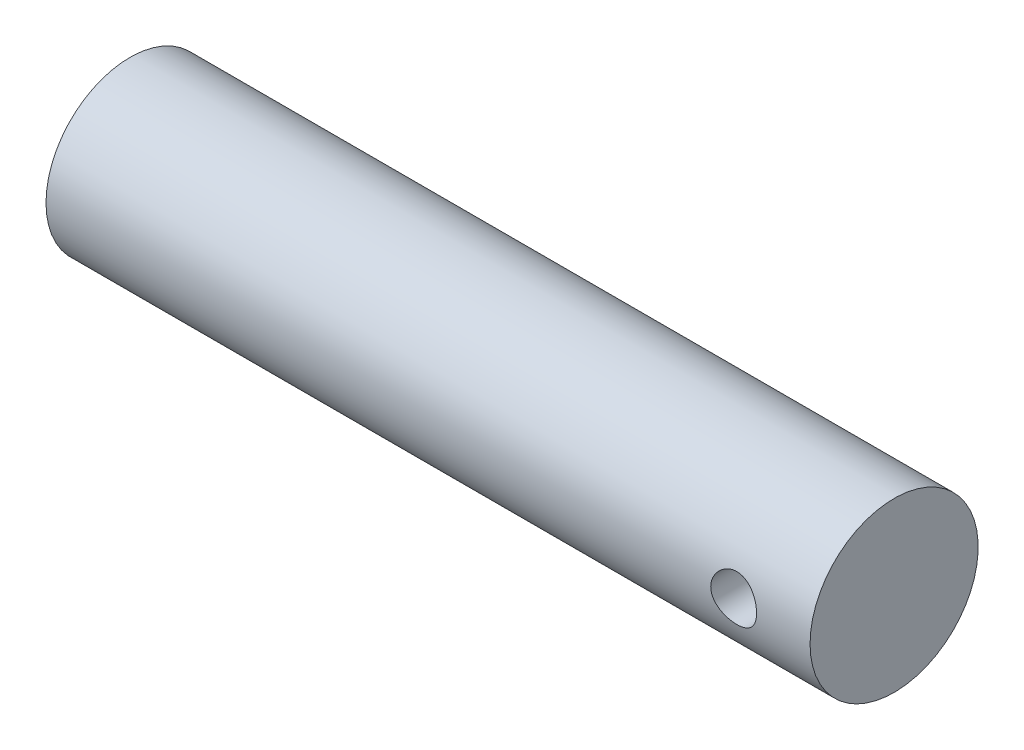
ISO-10303-21;
HEADER;
FILE_DESCRIPTION(('STEP AP214'),'2;1');
FILE_NAME('part.step','',(''),(''),'','','');
FILE_SCHEMA(('AUTOMOTIVE_DESIGN { 1 0 10303 214 1 1 1 1 }'));
ENDSEC;
DATA;
#1=APPLICATION_CONTEXT('core data for automotive mechanical design processes');
#2=APPLICATION_PROTOCOL_DEFINITION('international standard','automotive_design',2000,#1);
#3=PRODUCT_CONTEXT('',#1,'mechanical');
#4=PRODUCT('Part','Part','',(#3));
#5=PRODUCT_RELATED_PRODUCT_CATEGORY('part','',(#4));
#6=PRODUCT_DEFINITION_FORMATION('','',#4);
#7=PRODUCT_DEFINITION_CONTEXT('part definition',#1,'design');
#8=PRODUCT_DEFINITION('design','',#6,#7);
#9=PRODUCT_DEFINITION_SHAPE('','',#8);
#10=(LENGTH_UNIT() NAMED_UNIT(*) SI_UNIT(.MILLI.,.METRE.));
#11=(NAMED_UNIT(*) PLANE_ANGLE_UNIT() SI_UNIT($,.RADIAN.));
#12=(NAMED_UNIT(*) SI_UNIT($,.STERADIAN.) SOLID_ANGLE_UNIT());
#13=UNCERTAINTY_MEASURE_WITH_UNIT(LENGTH_MEASURE(1.E-05),#10,'distance_accuracy_value','');
#14=(GEOMETRIC_REPRESENTATION_CONTEXT(3) GLOBAL_UNCERTAINTY_ASSIGNED_CONTEXT((#13)) GLOBAL_UNIT_ASSIGNED_CONTEXT((#10,
#11,#12)) REPRESENTATION_CONTEXT('',''));
#15=CARTESIAN_POINT('',(0.,0.,0.));
#16=DIRECTION('',(0.,0.,1.));
#17=DIRECTION('',(1.,0.,0.));
#18=AXIS2_PLACEMENT_3D('',#15,#16,#17);
#19=CARTESIAN_POINT('',(0.,0.,0.));
#20=DIRECTION('',(-1.,0.,0.));
#21=DIRECTION('',(0.,0.,0.999999999999998));
#22=AXIS2_PLACEMENT_3D('',#19,#20,#21);
#23=PLANE('',#22);
#24=CARTESIAN_POINT('',(0.,0.,0.));
#25=DIRECTION('',(-1.,0.,0.));
#26=DIRECTION('',(0.,0.,0.999999999999998));
#27=AXIS2_PLACEMENT_3D('',#24,#25,#26);
#28=CIRCLE('',#27,11.);
#29=CARTESIAN_POINT('',(0.,0.,11.));
#30=VERTEX_POINT('',#29);
#31=EDGE_CURVE('E53',#30,#30,#28,.T.);
#32=ORIENTED_EDGE('',*,*,#31,.F.);
#33=EDGE_LOOP('',(#32));
#34=FACE_BOUND('',#33,.T.);
#35=ADVANCED_FACE('F36',(#34),#23,.F.);
#36=CARTESIAN_POINT('',(-100.,-2.4980018054066E-13,0.));
#37=DIRECTION('',(-1.,0.,0.));
#38=DIRECTION('',(0.,0.,0.999999999999998));
#39=AXIS2_PLACEMENT_3D('',#36,#37,#38);
#40=CYLINDRICAL_SURFACE('',#39,11.);
#41=CARTESIAN_POINT('',(-7.00000000000001,-6.66133814775094E-13,-10.9999999999999));
#42=CARTESIAN_POINT('',(-7.000003625222,0.165241826663786,-10.9999976543482));
#43=CARTESIAN_POINT('',(-7.0136981271666,0.330521957624909,-10.9962401452152));
#44=CARTESIAN_POINT('',(-7.06801166060656,0.656311860314915,-10.981615961709));
#45=CARTESIAN_POINT('',(-7.10864278325801,0.816819455953981,-10.9707460948099));
#46=CARTESIAN_POINT('',(-7.21540346347778,1.12831525211038,-10.9430954434826));
#47=CARTESIAN_POINT('',(-7.28149930532425,1.27931573394014,-10.9263224773878));
#48=CARTESIAN_POINT('',(-7.43718586532478,1.56808899231948,-10.8886330882569));
#49=CARTESIAN_POINT('',(-7.52677843270781,1.70586072657962,-10.8677163391303));
#50=CARTESIAN_POINT('',(-7.72919967293461,1.96759389514644,-10.8234279408412));
#51=CARTESIAN_POINT('',(-7.8424908817086,2.09119025833961,-10.8000128298086));
#52=CARTESIAN_POINT('',(-8.08810527205994,2.31788587364934,-10.7536422587012));
#53=CARTESIAN_POINT('',(-8.22043102080461,2.42098235649443,-10.730686861104));
#54=CARTESIAN_POINT('',(-8.50330249515892,2.60555589078989,-10.6873876832731));
#55=CARTESIAN_POINT('',(-8.65413428987268,2.68660853675138,-10.6670986011724));
#56=CARTESIAN_POINT('',(-8.96792765639892,2.82205832722425,-10.6320701482383));
#57=CARTESIAN_POINT('',(-9.13088686977704,2.87646063893691,-10.6173297017151));
#58=CARTESIAN_POINT('',(-9.46025579002493,2.95578912882533,-10.5955169438548));
#59=CARTESIAN_POINT('',(-9.62649389632387,2.9813792108642,-10.5882722456757));
#60=CARTESIAN_POINT('',(-9.96104936601767,3.00442728818228,-10.5817565816816));
#61=CARTESIAN_POINT('',(-10.1293663150001,3.00189080281761,-10.5824840514652));
#62=CARTESIAN_POINT('',(-10.4580831019325,2.96928383560604,-10.5916764975091));
#63=CARTESIAN_POINT('',(-10.6185704692044,2.94002147337838,-10.5999143662734));
#64=CARTESIAN_POINT('',(-10.9322665720456,2.85608967743566,-10.6228351158812));
#65=CARTESIAN_POINT('',(-11.0854747009326,2.80141813009254,-10.637518532883));
#66=CARTESIAN_POINT('',(-11.3823470410949,2.66757259652892,-10.6718723658465));
#67=CARTESIAN_POINT('',(-11.5258784020672,2.5881190376583,-10.6915991952828));
#68=CARTESIAN_POINT('',(-11.7978528948198,2.40715976044308,-10.7337873759559));
#69=CARTESIAN_POINT('',(-11.9262929256784,2.3056495221242,-10.7562492872649));
#70=CARTESIAN_POINT('',(-12.1690503796136,2.07934693365789,-10.802317899812));
#71=CARTESIAN_POINT('',(-12.282734898578,1.95387729233397,-10.8259374859423));
#72=CARTESIAN_POINT('',(-12.4875819299557,1.68536402357671,-10.8709729541596));
#73=CARTESIAN_POINT('',(-12.5787434721001,1.54231963943702,-10.8923887412858));
#74=CARTESIAN_POINT('',(-12.7362533455507,1.24170790747931,-10.9307455624251));
#75=CARTESIAN_POINT('',(-12.8024826771681,1.08407527483528,-10.947665025746));
#76=CARTESIAN_POINT('',(-12.9073159450281,0.759345377428227,-10.9749671228522));
#77=CARTESIAN_POINT('',(-12.9459262048882,0.592250288634851,-10.9853512528913));
#78=CARTESIAN_POINT('',(-12.993421235594,0.258736340966014,-10.9981845755262));
#79=CARTESIAN_POINT('',(-13.0031659906407,0.092448595567462,-11.0008632625073));
#80=CARTESIAN_POINT('',(-12.9950345049731,-0.239386731276429,-10.9986460317027));
#81=CARTESIAN_POINT('',(-12.977161260767,-0.404934391065475,-10.9937509356601));
#82=CARTESIAN_POINT('',(-12.9150049945937,-0.727490195479545,-10.9770847853189));
#83=CARTESIAN_POINT('',(-12.871205614486,-0.884598648545782,-10.9654397294419));
#84=CARTESIAN_POINT('',(-12.759005510719,-1.18921973489771,-10.9365984707135));
#85=CARTESIAN_POINT('',(-12.6906020606772,-1.33673130261046,-10.9194016526917));
#86=CARTESIAN_POINT('',(-12.5295671154288,-1.62128232238952,-10.8808314765631));
#87=CARTESIAN_POINT('',(-12.4364730254775,-1.75804920482536,-10.8593805909886));
#88=CARTESIAN_POINT('',(-12.229277424909,-2.01432044026203,-10.8147797682095));
#89=CARTESIAN_POINT('',(-12.1151715676829,-2.13382121235601,-10.7916294800541));
#90=CARTESIAN_POINT('',(-11.8651719239323,-2.35582120688553,-10.7453880311357));
#91=CARTESIAN_POINT('',(-11.7287332354502,-2.45771255494181,-10.7223188995483));
#92=CARTESIAN_POINT('',(-11.4402027055535,-2.6371716441625,-10.6796005238856));
#93=CARTESIAN_POINT('',(-11.2881114907549,-2.71474035852962,-10.6599511429925));
#94=CARTESIAN_POINT('',(-10.9733187435356,-2.84277116633805,-10.6265249735947));
#95=CARTESIAN_POINT('',(-10.8106834790395,-2.89338704610693,-10.6127149622545));
#96=CARTESIAN_POINT('',(-10.4787663240444,-2.96641834438092,-10.5925362923411));
#97=CARTESIAN_POINT('',(-10.3094862409314,-2.98884137725637,-10.5861656245709));
#98=CARTESIAN_POINT('',(-9.97532319232937,-3.00439791154406,-10.5817601934994));
#99=CARTESIAN_POINT('',(-9.81048882250407,-2.99851066433424,-10.5834467188084));
#100=CARTESIAN_POINT('',(-9.4842587044943,-2.95989675286981,-10.5943100332907));
#101=CARTESIAN_POINT('',(-9.32286286010055,-2.92717084057045,-10.6034866126106));
#102=CARTESIAN_POINT('',(-9.00938736846221,-2.83638816870617,-10.6281263302191));
#103=CARTESIAN_POINT('',(-8.85724049352032,-2.77854790898381,-10.6435356626191));
#104=CARTESIAN_POINT('',(-8.56469344636938,-2.63934609082717,-10.6789037996564));
#105=CARTESIAN_POINT('',(-8.42429519786854,-2.55798069008931,-10.6988633473566));
#106=CARTESIAN_POINT('',(-8.15457880461579,-2.37110861969773,-10.741847587665));
#107=CARTESIAN_POINT('',(-8.02573259031412,-2.26493803644297,-10.7649475169128));
#108=CARTESIAN_POINT('',(-7.78736718641056,-2.03272022398587,-10.8111998098093));
#109=CARTESIAN_POINT('',(-7.67785275198926,-1.90666811877654,-10.8343521849439));
#110=CARTESIAN_POINT('',(-7.47881077096122,-1.63481545137274,-10.8787291835493));
#111=CARTESIAN_POINT('',(-7.38979303826603,-1.48863173252549,-10.8998981550766));
#112=CARTESIAN_POINT('',(-7.23773512757703,-1.18279979967877,-10.9373052756074));
#113=CARTESIAN_POINT('',(-7.17467903889136,-1.02315990484255,-10.9535464430238));
#114=CARTESIAN_POINT('',(-7.08412098004204,-0.720200202436521,-10.9772838799153));
#115=CARTESIAN_POINT('',(-7.05265089751658,-0.578129280525134,-10.9857389536218));
#116=CARTESIAN_POINT('',(-7.01058994936235,-0.290715215883395,-10.997097743287));
#117=CARTESIAN_POINT('',(-6.99999681069046,-0.145372431130452,-11.0000020636003));
#118=CARTESIAN_POINT('',(-7.00000000000001,-6.66133814775094E-13,-10.9999999999999));
#119=B_SPLINE_CURVE_WITH_KNOTS('',3,(#41,#42,#43,#44,#45,#46,#47,#48,#49,#50,#51,#52,#53,#54,
#55,#56,#57,#58,#59,#60,#61,#62,#63,#64,#65,#66,#67,#68,#69,#70,#71,#72,#73,#74,#75,#76,#77,#78,
#79,#80,#81,#82,#83,#84,#85,#86,#87,#88,#89,#90,#91,#92,#93,#94,#95,#96,#97,#98,#99,#100,#101,
#102,#103,#104,#105,#106,#107,#108,#109,#110,#111,#112,#113,#114,#115,#116,#117,#118),
.UNSPECIFIED.,.T.,.F.,(4,2,2,2,2,2,2,2,2,2,2,2,2,2,2,2,2,2,2,2,2,2,2,2,2,2,2,2,2,2,2,2,2,2,2,2,
2,2,4),(0.,0.495192213709939,0.990606857103038,1.48536780484168,1.98016770272987,
2.48571756446394,2.99133567318685,3.50609187300477,4.0207482278203,4.52328609721884,
5.025725353931,5.513457733498,6.00123069167469,6.49471853535915,6.9883076027832,
7.49877057101618,8.00925552568906,8.52214699472121,9.03492099533964,9.53225622686239,
10.0295375021057,10.5178222240046,11.0061610695174,11.5043893801941,12.0027208731204,
12.5158014612979,13.0288615173588,13.5389619291422,14.0489245425552,14.541377044674,
15.0338157499221,15.5220911132466,16.010446270482,16.513780227972,17.0172378222295,
17.5321174459115,18.0466810522793,18.4823766419941,18.9180247913561),.UNSPECIFIED.);
#120=CARTESIAN_POINT('',(-7.00000000000001,-6.66133814775094E-13,-10.9999999999999));
#121=VERTEX_POINT('',#120);
#122=EDGE_CURVE('E10',#121,#121,#119,.T.);
#123=ORIENTED_EDGE('',*,*,#122,.T.);
#124=EDGE_LOOP('',(#123));
#125=FACE_BOUND('',#124,.T.);
#126=CARTESIAN_POINT('',(-6.99999999999995,-7.49400541621981E-13,11.));
#127=CARTESIAN_POINT('',(-7.00000362522202,-0.165241826665087,10.9999976543483));
#128=CARTESIAN_POINT('',(-7.01369812716686,-0.330521957626065,10.9962401452152));
#129=CARTESIAN_POINT('',(-7.06801166060642,-0.656311860315938,10.981615961709));
#130=CARTESIAN_POINT('',(-7.10864278325722,-0.816819455955018,10.97074609481));
#131=CARTESIAN_POINT('',(-7.21540346347681,-1.12831525211117,10.9430954434827));
#132=CARTESIAN_POINT('',(-7.28149930532374,-1.27931573394066,10.9263224773879));
#133=CARTESIAN_POINT('',(-7.43718586532479,-1.56808899231959,10.888633088257));
#134=CARTESIAN_POINT('',(-7.52677843270787,-1.70586072657957,10.8677163391304));
#135=CARTESIAN_POINT('',(-7.72919967293451,-1.96759389514658,10.8234279408412));
#136=CARTESIAN_POINT('',(-7.84249088170829,-2.09119025834009,10.8000128298086));
#137=CARTESIAN_POINT('',(-8.08810527205967,-2.31788587364988,10.7536422587013));
#138=CARTESIAN_POINT('',(-8.22043102080458,-2.42098235649469,10.7306868611041));
#139=CARTESIAN_POINT('',(-8.50330249515891,-2.60555589079026,10.6873876832732));
#140=CARTESIAN_POINT('',(-8.65413428987245,-2.68660853675215,10.6670986011725));
#141=CARTESIAN_POINT('',(-8.96792765639865,-2.8220583272248,10.6320701482383));
#142=CARTESIAN_POINT('',(-9.13088686977695,-2.87646063893685,10.6173297017151));
#143=CARTESIAN_POINT('',(-9.46025579002495,-2.9557891288254,10.5955169438548));
#144=CARTESIAN_POINT('',(-9.62649389632382,-2.98137921086497,10.5882722456757));
#145=CARTESIAN_POINT('',(-9.96104936601757,-3.00442728818305,10.5817565816817));
#146=CARTESIAN_POINT('',(-10.129366315,-3.00189080281766,10.5824840514652));
#147=CARTESIAN_POINT('',(-10.4580831019326,-2.96928383560604,10.5916764975091));
#148=CARTESIAN_POINT('',(-10.6185704692046,-2.94002147337901,10.5999143662734));
#149=CARTESIAN_POINT('',(-10.9322665720457,-2.85608967743652,10.6228351158812));
#150=CARTESIAN_POINT('',(-11.0854747009326,-2.80141813009299,10.6375185328831));
#151=CARTESIAN_POINT('',(-11.3823470410949,-2.66757259652938,10.6718723658465));
#152=CARTESIAN_POINT('',(-11.5258784020674,-2.58811903765919,10.6915991952828));
#153=CARTESIAN_POINT('',(-11.7978528948195,-2.40715976044382,10.7337873759559));
#154=CARTESIAN_POINT('',(-11.9262929256775,-2.30564952212436,10.756249287265));
#155=CARTESIAN_POINT('',(-12.1690503796129,-2.07934693365802,10.8023178998121));
#156=CARTESIAN_POINT('',(-12.2827348985781,-1.95387729233468,10.8259374859423));
#157=CARTESIAN_POINT('',(-12.4875819299558,-1.68536402357734,10.8709729541596));
#158=CARTESIAN_POINT('',(-12.5787434720993,-1.542319639437,10.8923887412859));
#159=CARTESIAN_POINT('',(-12.7362533455498,-1.24170790747912,10.9307455624253));
#160=CARTESIAN_POINT('',(-12.8024826771679,-1.08407527483561,10.9476650257461));
#161=CARTESIAN_POINT('',(-12.9073159450284,-0.759345377429084,10.9749671228523));
#162=CARTESIAN_POINT('',(-12.9459262048884,-0.592250288635723,10.9853512528913));
#163=CARTESIAN_POINT('',(-12.9934212355939,-0.25873634096695,10.9981845755263));
#164=CARTESIAN_POINT('',(-13.0031659906405,-0.0924485955684385,11.0008632625074));
#165=CARTESIAN_POINT('',(-12.9950345049734,0.239386731275493,10.9986460317028));
#166=CARTESIAN_POINT('',(-12.9771612607678,0.404934391064619,10.9937509356601));
#167=CARTESIAN_POINT('',(-12.9150049945946,0.727490195478652,10.977084785319));
#168=CARTESIAN_POINT('',(-12.8712056144863,0.884598648544773,10.965439729442));
#169=CARTESIAN_POINT('',(-12.7590055107188,1.18921973489668,10.9365984707136));
#170=CARTESIAN_POINT('',(-12.6906020606773,1.33673130260953,10.9194016526918));
#171=CARTESIAN_POINT('',(-12.5295671154289,1.62128232238871,10.8808314765632));
#172=CARTESIAN_POINT('',(-12.4364730254775,1.75804920482457,10.8593805909888));
#173=CARTESIAN_POINT('',(-12.229277424909,2.01432044026142,10.8147797682096));
#174=CARTESIAN_POINT('',(-12.1151715676829,2.13382121235555,10.7916294800542));
#175=CARTESIAN_POINT('',(-11.8651719239324,2.35582120688503,10.7453880311357));
#176=CARTESIAN_POINT('',(-11.7287332354502,2.45771255494113,10.7223188995484));
#177=CARTESIAN_POINT('',(-11.4402027055535,2.63717164416168,10.6796005238857));
#178=CARTESIAN_POINT('',(-11.2881114907549,2.71474035852882,10.6599511429925));
#179=CARTESIAN_POINT('',(-10.9733187435357,2.84277116633721,10.6265249735947));
#180=CARTESIAN_POINT('',(-10.8106834790395,2.893387046106,10.6127149622547));
#181=CARTESIAN_POINT('',(-10.4787663240444,2.96641834438032,10.5925362923413));
#182=CARTESIAN_POINT('',(-10.3094862409314,2.98884137725618,10.586165624571));
#183=CARTESIAN_POINT('',(-9.97532319232943,3.00439791154376,10.5817601934995));
#184=CARTESIAN_POINT('',(-9.81048882250418,2.99851066433344,10.5834467188086));
#185=CARTESIAN_POINT('',(-9.48425870449439,2.95989675286907,10.5943100332909));
#186=CARTESIAN_POINT('',(-9.32286286010057,2.92717084057027,10.6034866126106));
#187=CARTESIAN_POINT('',(-9.00938736846223,2.83638816870611,10.6281263302191));
#188=CARTESIAN_POINT('',(-8.85724049352044,2.77854790898331,10.6435356626192));
#189=CARTESIAN_POINT('',(-8.56469344636954,2.63934609082625,10.6789037996565));
#190=CARTESIAN_POINT('',(-8.42429519786866,2.5579806900884,10.6988633473566));
#191=CARTESIAN_POINT('',(-8.15457880461579,2.37110861969687,10.7418475876651));
#192=CARTESIAN_POINT('',(-8.02573259031404,2.26493803644216,10.764947516913));
#193=CARTESIAN_POINT('',(-7.78736718641048,2.03272022398498,10.8111998098094));
#194=CARTESIAN_POINT('',(-7.67785275198926,1.90666811877553,10.834352184944));
#195=CARTESIAN_POINT('',(-7.4788107709613,1.63481545137175,10.8787291835493));
#196=CARTESIAN_POINT('',(-7.38979303826609,1.48863173252465,10.8998981550767));
#197=CARTESIAN_POINT('',(-7.23773512757703,1.1827997996782,10.9373052756075));
#198=CARTESIAN_POINT('',(-7.17467903889132,1.02315990484211,10.9535464430238));
#199=CARTESIAN_POINT('',(-7.08412098004199,0.720200202436032,10.9772838799153));
#200=CARTESIAN_POINT('',(-7.05265089751659,0.578129280524471,10.9857389536219));
#201=CARTESIAN_POINT('',(-7.01058994936232,0.290715215882359,10.9970977432871));
#202=CARTESIAN_POINT('',(-6.99999681069034,0.145372431129214,11.0000020636004));
#203=CARTESIAN_POINT('',(-6.99999999999995,-7.49400541621981E-13,11.));
#204=B_SPLINE_CURVE_WITH_KNOTS('',3,(#126,#127,#128,#129,#130,#131,#132,#133,#134,#135,#136,
#137,#138,#139,#140,#141,#142,#143,#144,#145,#146,#147,#148,#149,#150,#151,#152,#153,#154,#155,
#156,#157,#158,#159,#160,#161,#162,#163,#164,#165,#166,#167,#168,#169,#170,#171,#172,#173,#174,
#175,#176,#177,#178,#179,#180,#181,#182,#183,#184,#185,#186,#187,#188,#189,#190,#191,#192,#193,
#194,#195,#196,#197,#198,#199,#200,#201,#202,#203),.UNSPECIFIED.,.T.,.F.,(4,2,2,2,2,2,2,2,2,2,2,
2,2,2,2,2,2,2,2,2,2,2,2,2,2,2,2,2,2,2,2,2,2,2,2,2,2,2,4),(0.,0.495192213709652,
0.990606857102298,1.48536780484064,1.98016770272871,2.48571756446301,2.99133567318602,
3.50609187300387,4.02074822781939,4.52328609721802,5.02572535393028,5.51345773349728,
6.00123069167394,6.49471853535816,6.98830760278201,7.49877057101524,8.00925552568837,
8.52214699472013,9.03492099533817,9.53225622686095,10.0295375021042,10.5178222240032,
11.0061610695162,11.5043893801931,12.0027208731195,12.5158014612968,13.0288615173577,
13.5389619291411,14.0489245425542,14.5413770446728,15.0338157499209,15.5220911132455,
16.010446270481,16.5137802279712,17.0172378222288,17.5321174459104,18.046681052278,
18.4823766419932,18.9180247913558),.UNSPECIFIED.);
#205=CARTESIAN_POINT('',(-6.99999999999995,-7.49400541621981E-13,11.));
#206=VERTEX_POINT('',#205);
#207=EDGE_CURVE('E47',#206,#206,#204,.T.);
#208=ORIENTED_EDGE('',*,*,#207,.T.);
#209=EDGE_LOOP('',(#208));
#210=FACE_BOUND('',#209,.T.);
#211=CARTESIAN_POINT('',(-100.,-2.4980018054066E-13,0.));
#212=DIRECTION('',(-1.,0.,0.));
#213=DIRECTION('',(0.,0.,0.999999999999998));
#214=AXIS2_PLACEMENT_3D('',#211,#212,#213);
#215=CIRCLE('',#214,11.);
#216=CARTESIAN_POINT('',(-100.,-2.49189557873249E-13,11.));
#217=VERTEX_POINT('',#216);
#218=EDGE_CURVE('E59',#217,#217,#215,.T.);
#219=ORIENTED_EDGE('',*,*,#218,.F.);
#220=EDGE_LOOP('',(#219));
#221=FACE_BOUND('',#220,.T.);
#222=ORIENTED_EDGE('',*,*,#31,.T.);
#223=EDGE_LOOP('',(#222));
#224=FACE_BOUND('',#223,.T.);
#225=ADVANCED_FACE('F65',(#125,#210,#221,#224),#40,.T.);
#226=CARTESIAN_POINT('',(-100.,10.9999999999996,0.));
#227=DIRECTION('',(1.,0.,0.));
#228=DIRECTION('',(0.,0.,-0.999999999999998));
#229=AXIS2_PLACEMENT_3D('',#226,#227,#228);
#230=PLANE('',#229);
#231=ORIENTED_EDGE('',*,*,#218,.T.);
#232=EDGE_LOOP('',(#231));
#233=FACE_BOUND('',#232,.T.);
#234=ADVANCED_FACE('F71',(#233),#230,.F.);
#235=CARTESIAN_POINT('',(-10.,-3.88578058618805E-13,-10.9999999999999));
#236=DIRECTION('',(0.,0.,0.999999999999998));
#237=DIRECTION('',(1.,0.,0.));
#238=AXIS2_PLACEMENT_3D('',#235,#236,#237);
#239=CYLINDRICAL_SURFACE('',#238,3.);
#240=ORIENTED_EDGE('',*,*,#207,.F.);
#241=EDGE_LOOP('',(#240));
#242=FACE_BOUND('',#241,.T.);
#243=ORIENTED_EDGE('',*,*,#122,.F.);
#244=EDGE_LOOP('',(#243));
#245=FACE_BOUND('',#244,.T.);
#246=ADVANCED_FACE('F68',(#242,#245),#239,.F.);
#247=CLOSED_SHELL('',(#35,#225,#234,#246));
#248=MANIFOLD_SOLID_BREP('B2',#247);
#249=ADVANCED_BREP_SHAPE_REPRESENTATION('',(#18,#248),#14);
#250=SHAPE_DEFINITION_REPRESENTATION(#9,#249);
ENDSEC;
END-ISO-10303-21;
